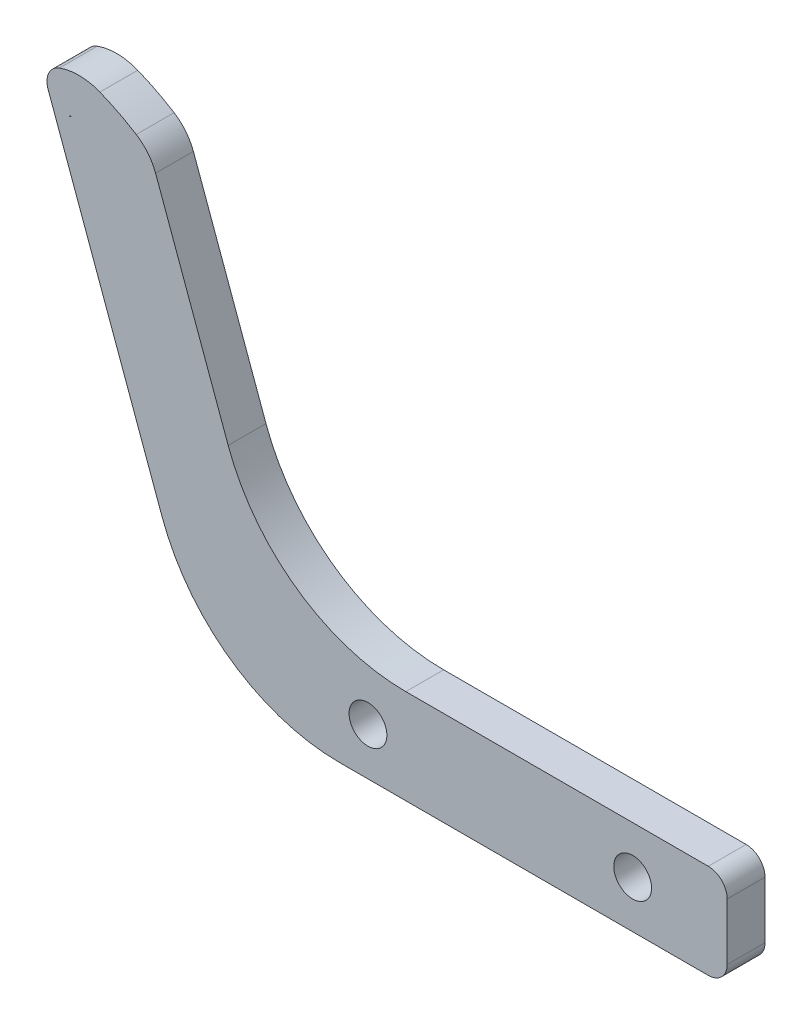
ISO-10303-21;
HEADER;
FILE_DESCRIPTION(('STEP AP214'),'2;1');
FILE_NAME('part.step','',(''),(''),'','','');
FILE_SCHEMA(('AUTOMOTIVE_DESIGN { 1 0 10303 214 1 1 1 1 }'));
ENDSEC;
DATA;
#1=APPLICATION_CONTEXT('core data for automotive mechanical design processes');
#2=APPLICATION_PROTOCOL_DEFINITION('international standard','automotive_design',2000,#1);
#3=PRODUCT_CONTEXT('',#1,'mechanical');
#4=PRODUCT('Part','Part','',(#3));
#5=PRODUCT_RELATED_PRODUCT_CATEGORY('part','',(#4));
#6=PRODUCT_DEFINITION_FORMATION('','',#4);
#7=PRODUCT_DEFINITION_CONTEXT('part definition',#1,'design');
#8=PRODUCT_DEFINITION('design','',#6,#7);
#9=PRODUCT_DEFINITION_SHAPE('','',#8);
#10=(LENGTH_UNIT() NAMED_UNIT(*) SI_UNIT(.MILLI.,.METRE.));
#11=(NAMED_UNIT(*) PLANE_ANGLE_UNIT() SI_UNIT($,.RADIAN.));
#12=(NAMED_UNIT(*) SI_UNIT($,.STERADIAN.) SOLID_ANGLE_UNIT());
#13=UNCERTAINTY_MEASURE_WITH_UNIT(LENGTH_MEASURE(1.E-05),#10,'distance_accuracy_value','');
#14=(GEOMETRIC_REPRESENTATION_CONTEXT(3) GLOBAL_UNCERTAINTY_ASSIGNED_CONTEXT((#13)) GLOBAL_UNIT_ASSIGNED_CONTEXT((#10,
#11,#12)) REPRESENTATION_CONTEXT('',''));
#15=CARTESIAN_POINT('',(0.,0.,0.));
#16=DIRECTION('',(0.,0.,1.));
#17=DIRECTION('',(1.,0.,0.));
#18=AXIS2_PLACEMENT_3D('',#15,#16,#17);
#19=CARTESIAN_POINT('',(-58.5846758968649,38.1711990775723,4.));
#20=DIRECTION('',(0.,0.,-1.));
#21=DIRECTION('',(-1.,0.,0.));
#22=AXIS2_PLACEMENT_3D('',#19,#20,#21);
#23=CYLINDRICAL_SURFACE('',#22,2.);
#24=CARTESIAN_POINT('',(-58.5846758968649,38.1711990775723,0.));
#25=DIRECTION('',(0.,0.,1.));
#26=DIRECTION('',(1.,0.,0.));
#27=AXIS2_PLACEMENT_3D('',#24,#25,#26);
#28=CIRCLE('',#27,2.);
#29=CARTESIAN_POINT('',(-59.572682652042,39.9101190445991,0.));
#30=VERTEX_POINT('',#29);
#31=CARTESIAN_POINT('',(-59.2687161835162,40.0505843191441,0.));
#32=VERTEX_POINT('',#31);
#33=EDGE_CURVE('E173',#30,#32,#28,.F.);
#34=ORIENTED_EDGE('',*,*,#33,.F.);
#35=DIRECTION('',(0.,0.,1.));
#36=VECTOR('',#35,1.);
#37=CARTESIAN_POINT('',(-59.572682652042,39.9101190445991,0.));
#38=LINE('',#37,#36);
#39=CARTESIAN_POINT('',(-59.572682652042,39.9101190445991,4.));
#40=VERTEX_POINT('',#39);
#41=EDGE_CURVE('E165',#30,#40,#38,.T.);
#42=ORIENTED_EDGE('',*,*,#41,.T.);
#43=CARTESIAN_POINT('',(-58.5846758968649,38.1711990775723,4.));
#44=DIRECTION('',(0.,0.,1.));
#45=DIRECTION('',(1.,0.,0.));
#46=AXIS2_PLACEMENT_3D('',#43,#44,#45);
#47=CIRCLE('',#46,2.);
#48=CARTESIAN_POINT('',(-59.2687161835162,40.0505843191441,4.));
#49=VERTEX_POINT('',#48);
#50=EDGE_CURVE('E285',#49,#40,#47,.T.);
#51=ORIENTED_EDGE('',*,*,#50,.F.);
#52=DIRECTION('',(0.,0.,1.));
#53=VECTOR('',#52,1.);
#54=CARTESIAN_POINT('',(-59.2687161835162,40.0505843191441,0.));
#55=LINE('',#54,#53);
#56=EDGE_CURVE('E158',#32,#49,#55,.T.);
#57=ORIENTED_EDGE('',*,*,#56,.F.);
#58=EDGE_LOOP('',(#34,#42,#51,#57));
#59=FACE_BOUND('',#58,.T.);
#60=ADVANCED_FACE('F37',(#59),#23,.T.);
#61=CARTESIAN_POINT('',(-31.9460427865344,-11.6274086768929,4.));
#62=DIRECTION('',(0.93969262078591,0.342020143325665,0.));
#63=DIRECTION('',(-0.342020143325665,0.93969262078591,0.));
#64=AXIS2_PLACEMENT_3D('',#61,#62,#63);
#65=PLANE('',#64);
#66=DIRECTION('',(0.342020143325665,-0.93969262078591,0.));
#67=VECTOR('',#66,1.);
#68=CARTESIAN_POINT('',(-31.9460427865344,-11.6274086768929,0.));
#69=LINE('',#68,#67);
#70=CARTESIAN_POINT('',(-50.4670591952752,39.2586656914718,0.));
#71=VERTEX_POINT('',#70);
#72=CARTESIAN_POINT('',(-42.7876262694269,18.1595971334867,0.));
#73=VERTEX_POINT('',#72);
#74=EDGE_CURVE('E233',#71,#73,#69,.T.);
#75=ORIENTED_EDGE('',*,*,#74,.F.);
#76=DIRECTION('',(0.,0.,1.));
#77=VECTOR('',#76,1.);
#78=CARTESIAN_POINT('',(-50.4670591952752,39.2586656914718,0.));
#79=LINE('',#78,#77);
#80=CARTESIAN_POINT('',(-50.4670591952752,39.2586656914718,4.));
#81=VERTEX_POINT('',#80);
#82=EDGE_CURVE('E212',#71,#81,#79,.T.);
#83=ORIENTED_EDGE('',*,*,#82,.T.);
#84=DIRECTION('',(0.342020143325665,-0.93969262078591,0.));
#85=VECTOR('',#84,1.);
#86=CARTESIAN_POINT('',(-31.9460427865344,-11.6274086768929,4.));
#87=LINE('',#86,#85);
#88=CARTESIAN_POINT('',(-42.7876262694269,18.1595971334867,4.));
#89=VERTEX_POINT('',#88);
#90=EDGE_CURVE('E216',#81,#89,#87,.T.);
#91=ORIENTED_EDGE('',*,*,#90,.T.);
#92=DIRECTION('',(0.,0.,-1.));
#93=VECTOR('',#92,1.);
#94=CARTESIAN_POINT('',(-42.7876262694268,18.1595971334867,0.));
#95=LINE('',#94,#93);
#96=EDGE_CURVE('E263',#89,#73,#95,.T.);
#97=ORIENTED_EDGE('',*,*,#96,.T.);
#98=EDGE_LOOP('',(#75,#83,#91,#97));
#99=FACE_BOUND('',#98,.T.);
#100=ADVANCED_FACE('F335',(#99),#65,.T.);
#101=CARTESIAN_POINT('',(-41.3429689943934,-15.0476101101496,4.));
#102=DIRECTION('',(0.939692620785909,0.342020143325666,0.));
#103=DIRECTION('',(-0.342020143325666,0.939692620785909,0.));
#104=AXIS2_PLACEMENT_3D('',#101,#102,#103);
#105=PLANE('',#104);
#106=DIRECTION('',(0.342020143325666,-0.939692620785909,0.));
#107=VECTOR('',#106,1.);
#108=CARTESIAN_POINT('',(-41.3429689943934,-15.0476101101496,4.));
#109=LINE('',#108,#107);
#110=CARTESIAN_POINT('',(-61.8321417117394,41.2459292740646,4.));
#111=VERTEX_POINT('',#110);
#112=CARTESIAN_POINT('',(-49.789701651524,8.15959713348668,4.));
#113=VERTEX_POINT('',#112);
#114=EDGE_CURVE('E218',#111,#113,#109,.T.);
#115=ORIENTED_EDGE('',*,*,#114,.F.);
#116=DIRECTION('',(0.,0.,1.));
#117=VECTOR('',#116,1.);
#118=CARTESIAN_POINT('',(-61.8321417117394,41.2459292740646,0.));
#119=LINE('',#118,#117);
#120=CARTESIAN_POINT('',(-61.8321417117394,41.2459292740646,0.));
#121=VERTEX_POINT('',#120);
#122=EDGE_CURVE('E203',#121,#111,#119,.T.);
#123=ORIENTED_EDGE('',*,*,#122,.F.);
#124=DIRECTION('',(0.342020143325666,-0.939692620785909,0.));
#125=VECTOR('',#124,1.);
#126=CARTESIAN_POINT('',(-41.3429689943934,-15.0476101101496,0.));
#127=LINE('',#126,#125);
#128=CARTESIAN_POINT('',(-49.789701651524,8.15959713348668,0.));
#129=VERTEX_POINT('',#128);
#130=EDGE_CURVE('E235',#121,#129,#127,.T.);
#131=ORIENTED_EDGE('',*,*,#130,.T.);
#132=DIRECTION('',(0.,0.,-1.));
#133=VECTOR('',#132,1.);
#134=CARTESIAN_POINT('',(-49.789701651524,8.15959713348668,4.));
#135=LINE('',#134,#133);
#136=EDGE_CURVE('E258',#129,#113,#135,.F.);
#137=ORIENTED_EDGE('',*,*,#136,.T.);
#138=EDGE_LOOP('',(#115,#123,#131,#137));
#139=FACE_BOUND('',#138,.T.);
#140=ADVANCED_FACE('F312',(#139),#105,.F.);
#141=CARTESIAN_POINT('',(0.,-5.,4.));
#142=DIRECTION('',(0.,1.,0.));
#143=DIRECTION('',(0.,0.,1.));
#144=AXIS2_PLACEMENT_3D('',#141,#142,#143);
#145=PLANE('',#144);
#146=DIRECTION('',(1.,0.,0.));
#147=VECTOR('',#146,1.);
#148=CARTESIAN_POINT('',(0.,-5.,0.));
#149=LINE('',#148,#147);
#150=CARTESIAN_POINT('',(-30.9958492358058,-5.,0.));
#151=VERTEX_POINT('',#150);
#152=CARTESIAN_POINT('',(8.,-5.,0.));
#153=VERTEX_POINT('',#152);
#154=EDGE_CURVE('E238',#151,#153,#149,.T.);
#155=ORIENTED_EDGE('',*,*,#154,.T.);
#156=DIRECTION('',(0.,0.,-1.));
#157=VECTOR('',#156,1.);
#158=CARTESIAN_POINT('',(8.,-5.,4.));
#159=LINE('',#158,#157);
#160=CARTESIAN_POINT('',(8.,-5.,4.));
#161=VERTEX_POINT('',#160);
#162=EDGE_CURVE('E283',#153,#161,#159,.F.);
#163=ORIENTED_EDGE('',*,*,#162,.T.);
#164=DIRECTION('',(1.,0.,0.));
#165=VECTOR('',#164,1.);
#166=CARTESIAN_POINT('',(0.,-5.,4.));
#167=LINE('',#166,#165);
#168=CARTESIAN_POINT('',(-30.9958492358058,-5.,4.));
#169=VERTEX_POINT('',#168);
#170=EDGE_CURVE('E221',#169,#161,#167,.T.);
#171=ORIENTED_EDGE('',*,*,#170,.F.);
#172=DIRECTION('',(0.,0.,-1.));
#173=VECTOR('',#172,1.);
#174=CARTESIAN_POINT('',(-30.9958492358058,-5.,4.));
#175=LINE('',#174,#173);
#176=EDGE_CURVE('E232',#169,#151,#175,.T.);
#177=ORIENTED_EDGE('',*,*,#176,.T.);
#178=EDGE_LOOP('',(#155,#163,#171,#177));
#179=FACE_BOUND('',#178,.T.);
#180=ADVANCED_FACE('F302',(#179),#145,.F.);
#181=CARTESIAN_POINT('',(-28.,0.,4.));
#182=DIRECTION('',(0.,0.,-1.));
#183=DIRECTION('',(-1.,0.,0.));
#184=AXIS2_PLACEMENT_3D('',#181,#182,#183);
#185=CYLINDRICAL_SURFACE('',#184,2.);
#186=CARTESIAN_POINT('',(-28.,0.,4.));
#187=DIRECTION('',(0.,0.,1.));
#188=DIRECTION('',(1.,0.,0.));
#189=AXIS2_PLACEMENT_3D('',#186,#187,#188);
#190=CIRCLE('',#189,2.);
#191=CARTESIAN_POINT('',(-26.,0.,4.));
#192=VERTEX_POINT('',#191);
#193=EDGE_CURVE('E226',#192,#192,#190,.T.);
#194=ORIENTED_EDGE('',*,*,#193,.T.);
#195=EDGE_LOOP('',(#194));
#196=FACE_BOUND('',#195,.T.);
#197=CARTESIAN_POINT('',(-28.,0.,0.));
#198=DIRECTION('',(0.,0.,1.));
#199=DIRECTION('',(1.,0.,0.));
#200=AXIS2_PLACEMENT_3D('',#197,#198,#199);
#201=CIRCLE('',#200,2.);
#202=CARTESIAN_POINT('',(-26.,0.,0.));
#203=VERTEX_POINT('',#202);
#204=EDGE_CURVE('E244',#203,#203,#201,.T.);
#205=ORIENTED_EDGE('',*,*,#204,.F.);
#206=EDGE_LOOP('',(#205));
#207=FACE_BOUND('',#206,.T.);
#208=ADVANCED_FACE('F512',(#196,#207),#185,.F.);
#209=CARTESIAN_POINT('',(0.,5.,4.));
#210=DIRECTION('',(0.,1.,0.));
#211=DIRECTION('',(0.,0.,1.));
#212=AXIS2_PLACEMENT_3D('',#209,#210,#211);
#213=PLANE('',#212);
#214=DIRECTION('',(1.,0.,0.));
#215=VECTOR('',#214,1.);
#216=CARTESIAN_POINT('',(0.,5.,4.));
#217=LINE('',#216,#215);
#218=CARTESIAN_POINT('',(-23.9937738537087,5.,4.));
#219=VERTEX_POINT('',#218);
#220=CARTESIAN_POINT('',(8.,5.,4.));
#221=VERTEX_POINT('',#220);
#222=EDGE_CURVE('E224',#219,#221,#217,.T.);
#223=ORIENTED_EDGE('',*,*,#222,.T.);
#224=DIRECTION('',(0.,0.,-1.));
#225=VECTOR('',#224,1.);
#226=CARTESIAN_POINT('',(8.,5.,4.));
#227=LINE('',#226,#225);
#228=CARTESIAN_POINT('',(8.,5.,0.));
#229=VERTEX_POINT('',#228);
#230=EDGE_CURVE('E11',#221,#229,#227,.T.);
#231=ORIENTED_EDGE('',*,*,#230,.T.);
#232=DIRECTION('',(1.,0.,0.));
#233=VECTOR('',#232,1.);
#234=CARTESIAN_POINT('',(0.,5.,0.));
#235=LINE('',#234,#233);
#236=CARTESIAN_POINT('',(-23.9937738537087,5.,0.));
#237=VERTEX_POINT('',#236);
#238=EDGE_CURVE('E241',#237,#229,#235,.T.);
#239=ORIENTED_EDGE('',*,*,#238,.F.);
#240=DIRECTION('',(0.,0.,-1.));
#241=VECTOR('',#240,1.);
#242=CARTESIAN_POINT('',(-23.9937738537087,5.,4.));
#243=LINE('',#242,#241);
#244=EDGE_CURVE('E266',#237,#219,#243,.F.);
#245=ORIENTED_EDGE('',*,*,#244,.T.);
#246=EDGE_LOOP('',(#223,#231,#239,#245));
#247=FACE_BOUND('',#246,.T.);
#248=ADVANCED_FACE('F338',(#247),#213,.T.);
#249=CARTESIAN_POINT('',(0.,0.,4.));
#250=DIRECTION('',(0.,0.,-1.));
#251=DIRECTION('',(-1.,0.,0.));
#252=AXIS2_PLACEMENT_3D('',#249,#250,#251);
#253=CYLINDRICAL_SURFACE('',#252,2.);
#254=CARTESIAN_POINT('',(0.,0.,4.));
#255=DIRECTION('',(0.,0.,1.));
#256=DIRECTION('',(1.,0.,0.));
#257=AXIS2_PLACEMENT_3D('',#254,#255,#256);
#258=CIRCLE('',#257,2.);
#259=CARTESIAN_POINT('',(2.,0.,4.));
#260=VERTEX_POINT('',#259);
#261=EDGE_CURVE('E229',#260,#260,#258,.T.);
#262=ORIENTED_EDGE('',*,*,#261,.T.);
#263=EDGE_LOOP('',(#262));
#264=FACE_BOUND('',#263,.T.);
#265=CARTESIAN_POINT('',(0.,0.,0.));
#266=DIRECTION('',(0.,0.,1.));
#267=DIRECTION('',(1.,0.,0.));
#268=AXIS2_PLACEMENT_3D('',#265,#266,#267);
#269=CIRCLE('',#268,2.);
#270=CARTESIAN_POINT('',(2.,0.,0.));
#271=VERTEX_POINT('',#270);
#272=EDGE_CURVE('E219',#271,#271,#269,.T.);
#273=ORIENTED_EDGE('',*,*,#272,.F.);
#274=EDGE_LOOP('',(#273));
#275=FACE_BOUND('',#274,.T.);
#276=ADVANCED_FACE('F415',(#264,#275),#253,.F.);
#277=CARTESIAN_POINT('',(0.,0.,4.));
#278=DIRECTION('',(0.,0.,1.));
#279=DIRECTION('',(1.,0.,0.));
#280=AXIS2_PLACEMENT_3D('',#277,#278,#279);
#281=PLANE('',#280);
#282=CARTESIAN_POINT('',(-59.9527564701676,41.929969560716,4.));
#283=DIRECTION('',(0.,0.,1.));
#284=DIRECTION('',(1.,0.,0.));
#285=AXIS2_PLACEMENT_3D('',#282,#283,#284);
#286=CIRCLE('',#285,2.);
#287=CARTESIAN_POINT('',(-60.6367967568189,43.8093548022878,4.));
#288=VERTEX_POINT('',#287);
#289=EDGE_CURVE('E169',#288,#111,#286,.T.);
#290=ORIENTED_EDGE('',*,*,#289,.T.);
#291=ORIENTED_EDGE('',*,*,#114,.T.);
#292=CARTESIAN_POINT('',(-30.9958492358058,15.,4.));
#293=DIRECTION('',(0.,0.,1.));
#294=DIRECTION('',(1.,0.,0.));
#295=AXIS2_PLACEMENT_3D('',#292,#293,#294);
#296=CIRCLE('',#295,20.);
#297=EDGE_CURVE('E261',#113,#169,#296,.T.);
#298=ORIENTED_EDGE('',*,*,#297,.T.);
#299=ORIENTED_EDGE('',*,*,#170,.T.);
#300=CARTESIAN_POINT('',(8.,-3.,4.));
#301=DIRECTION('',(0.,0.,1.));
#302=DIRECTION('',(1.,0.,0.));
#303=AXIS2_PLACEMENT_3D('',#300,#301,#302);
#304=CIRCLE('',#303,2.);
#305=CARTESIAN_POINT('',(10.,-3.,4.));
#306=VERTEX_POINT('',#305);
#307=EDGE_CURVE('E44',#161,#306,#304,.T.);
#308=ORIENTED_EDGE('',*,*,#307,.T.);
#309=DIRECTION('',(0.,-1.,0.));
#310=VECTOR('',#309,1.);
#311=CARTESIAN_POINT('',(10.,5.,4.));
#312=LINE('',#311,#310);
#313=CARTESIAN_POINT('',(10.,3.,4.));
#314=VERTEX_POINT('',#313);
#315=EDGE_CURVE('E236',#314,#306,#312,.T.);
#316=ORIENTED_EDGE('',*,*,#315,.F.);
#317=CARTESIAN_POINT('',(8.,3.,4.));
#318=DIRECTION('',(0.,0.,1.));
#319=DIRECTION('',(1.,0.,0.));
#320=AXIS2_PLACEMENT_3D('',#317,#318,#319);
#321=CIRCLE('',#320,2.);
#322=EDGE_CURVE('E59',#314,#221,#321,.T.);
#323=ORIENTED_EDGE('',*,*,#322,.T.);
#324=ORIENTED_EDGE('',*,*,#222,.F.);
#325=CARTESIAN_POINT('',(-23.9937738537087,25.,4.));
#326=DIRECTION('',(0.,0.,1.));
#327=DIRECTION('',(1.,0.,0.));
#328=AXIS2_PLACEMENT_3D('',#325,#326,#327);
#329=CIRCLE('',#328,20.);
#330=EDGE_CURVE('E270',#219,#89,#329,.F.);
#331=ORIENTED_EDGE('',*,*,#330,.T.);
#332=ORIENTED_EDGE('',*,*,#90,.F.);
#333=CARTESIAN_POINT('',(-55.1655222992048,37.5485649748434,4.));
#334=DIRECTION('',(0.,0.,1.));
#335=DIRECTION('',(1.,0.,0.));
#336=AXIS2_PLACEMENT_3D('',#333,#334,#335);
#337=CIRCLE('',#336,5.);
#338=CARTESIAN_POINT('',(-52.5058424817868,41.7824878920467,4.));
#339=VERTEX_POINT('',#338);
#340=EDGE_CURVE('E190',#81,#339,#337,.T.);
#341=ORIENTED_EDGE('',*,*,#340,.T.);
#342=CARTESIAN_POINT('',(-65.2723056053933,21.459657889471,4.));
#343=DIRECTION('',(0.,0.,1.));
#344=DIRECTION('',(1.,0.,0.));
#345=AXIS2_PLACEMENT_3D('',#342,#343,#344);
#346=CIRCLE('',#345,24.);
#347=CARTESIAN_POINT('',(-56.3554659940221,43.7417128069394,4.));
#348=VERTEX_POINT('',#347);
#349=EDGE_CURVE('E193',#339,#348,#346,.T.);
#350=ORIENTED_EDGE('',*,*,#349,.T.);
#351=CARTESIAN_POINT('',(-58.5846758968649,38.1711990775723,4.));
#352=DIRECTION('',(0.,0.,1.));
#353=DIRECTION('',(1.,0.,0.));
#354=AXIS2_PLACEMENT_3D('',#351,#352,#353);
#355=CIRCLE('',#354,6.);
#356=EDGE_CURVE('E196',#348,#288,#355,.T.);
#357=ORIENTED_EDGE('',*,*,#356,.T.);
#358=EDGE_LOOP('',(#290,#291,#298,#299,#308,#316,#323,#324,#331,#332,#341,#350,#357));
#359=FACE_BOUND('',#358,.T.);
#360=ORIENTED_EDGE('',*,*,#50,.T.);
#361=CARTESIAN_POINT('',(-55.1655222992048,37.5485649748434,4.));
#362=DIRECTION('',(0.,0.,1.));
#363=DIRECTION('',(1.,0.,0.));
#364=AXIS2_PLACEMENT_3D('',#361,#362,#363);
#365=CIRCLE('',#364,5.);
#366=CARTESIAN_POINT('',(-59.5381790307102,39.9734099406959,4.));
#367=VERTEX_POINT('',#366);
#368=EDGE_CURVE('E187',#367,#40,#365,.T.);
#369=ORIENTED_EDGE('',*,*,#368,.F.);
#370=CARTESIAN_POINT('',(-59.9527564701676,41.929969560716,4.));
#371=DIRECTION('',(0.,0.,1.));
#372=DIRECTION('',(1.,0.,0.));
#373=AXIS2_PLACEMENT_3D('',#370,#371,#372);
#374=CIRCLE('',#373,2.);
#375=EDGE_CURVE('E51',#367,#49,#374,.T.);
#376=ORIENTED_EDGE('',*,*,#375,.T.);
#377=EDGE_LOOP('',(#360,#369,#376));
#378=FACE_BOUND('',#377,.T.);
#379=ORIENTED_EDGE('',*,*,#193,.F.);
#380=EDGE_LOOP('',(#379));
#381=FACE_BOUND('',#380,.T.);
#382=ORIENTED_EDGE('',*,*,#261,.F.);
#383=EDGE_LOOP('',(#382));
#384=FACE_BOUND('',#383,.T.);
#385=ADVANCED_FACE('F288',(#359,#378,#381,#384),#281,.T.);
#386=CARTESIAN_POINT('',(0.,0.,0.));
#387=DIRECTION('',(0.,0.,1.));
#388=DIRECTION('',(1.,0.,0.));
#389=AXIS2_PLACEMENT_3D('',#386,#387,#388);
#390=PLANE('',#389);
#391=CARTESIAN_POINT('',(-55.1655222992048,37.5485649748434,0.));
#392=DIRECTION('',(0.,0.,1.));
#393=DIRECTION('',(1.,0.,0.));
#394=AXIS2_PLACEMENT_3D('',#391,#392,#393);
#395=CIRCLE('',#394,5.);
#396=CARTESIAN_POINT('',(-52.5058424817868,41.7824878920467,0.));
#397=VERTEX_POINT('',#396);
#398=EDGE_CURVE('E174',#71,#397,#395,.T.);
#399=ORIENTED_EDGE('',*,*,#398,.F.);
#400=ORIENTED_EDGE('',*,*,#74,.T.);
#401=CARTESIAN_POINT('',(-23.9937738537087,25.,0.));
#402=DIRECTION('',(0.,0.,1.));
#403=DIRECTION('',(1.,0.,0.));
#404=AXIS2_PLACEMENT_3D('',#401,#402,#403);
#405=CIRCLE('',#404,20.);
#406=EDGE_CURVE('E268',#73,#237,#405,.T.);
#407=ORIENTED_EDGE('',*,*,#406,.T.);
#408=ORIENTED_EDGE('',*,*,#238,.T.);
#409=CARTESIAN_POINT('',(8.,3.,0.));
#410=DIRECTION('',(0.,0.,1.));
#411=DIRECTION('',(1.,0.,0.));
#412=AXIS2_PLACEMENT_3D('',#409,#410,#411);
#413=CIRCLE('',#412,2.);
#414=CARTESIAN_POINT('',(10.,3.,0.));
#415=VERTEX_POINT('',#414);
#416=EDGE_CURVE('E279',#229,#415,#413,.F.);
#417=ORIENTED_EDGE('',*,*,#416,.T.);
#418=DIRECTION('',(0.,-1.,0.));
#419=VECTOR('',#418,1.);
#420=CARTESIAN_POINT('',(10.,5.,0.));
#421=LINE('',#420,#419);
#422=CARTESIAN_POINT('',(10.,-3.,0.));
#423=VERTEX_POINT('',#422);
#424=EDGE_CURVE('E202',#415,#423,#421,.T.);
#425=ORIENTED_EDGE('',*,*,#424,.T.);
#426=CARTESIAN_POINT('',(8.,-3.,0.));
#427=DIRECTION('',(0.,0.,1.));
#428=DIRECTION('',(1.,0.,0.));
#429=AXIS2_PLACEMENT_3D('',#426,#427,#428);
#430=CIRCLE('',#429,2.);
#431=EDGE_CURVE('E281',#423,#153,#430,.F.);
#432=ORIENTED_EDGE('',*,*,#431,.T.);
#433=ORIENTED_EDGE('',*,*,#154,.F.);
#434=CARTESIAN_POINT('',(-30.9958492358058,15.,0.));
#435=DIRECTION('',(0.,0.,1.));
#436=DIRECTION('',(1.,0.,0.));
#437=AXIS2_PLACEMENT_3D('',#434,#435,#436);
#438=CIRCLE('',#437,20.);
#439=EDGE_CURVE('E255',#151,#129,#438,.F.);
#440=ORIENTED_EDGE('',*,*,#439,.T.);
#441=ORIENTED_EDGE('',*,*,#130,.F.);
#442=CARTESIAN_POINT('',(-59.9527564701676,41.929969560716,0.));
#443=DIRECTION('',(0.,0.,1.));
#444=DIRECTION('',(1.,0.,0.));
#445=AXIS2_PLACEMENT_3D('',#442,#443,#444);
#446=CIRCLE('',#445,2.);
#447=CARTESIAN_POINT('',(-60.6367967568189,43.8093548022878,0.));
#448=VERTEX_POINT('',#447);
#449=EDGE_CURVE('E159',#448,#121,#446,.T.);
#450=ORIENTED_EDGE('',*,*,#449,.F.);
#451=CARTESIAN_POINT('',(-58.5846758968649,38.1711990775723,0.));
#452=DIRECTION('',(0.,0.,1.));
#453=DIRECTION('',(1.,0.,0.));
#454=AXIS2_PLACEMENT_3D('',#451,#452,#453);
#455=CIRCLE('',#454,6.);
#456=CARTESIAN_POINT('',(-56.3554659940221,43.7417128069394,0.));
#457=VERTEX_POINT('',#456);
#458=EDGE_CURVE('E182',#457,#448,#455,.T.);
#459=ORIENTED_EDGE('',*,*,#458,.F.);
#460=CARTESIAN_POINT('',(-65.2723056053933,21.459657889471,0.));
#461=DIRECTION('',(0.,0.,1.));
#462=DIRECTION('',(1.,0.,0.));
#463=AXIS2_PLACEMENT_3D('',#460,#461,#462);
#464=CIRCLE('',#463,24.);
#465=EDGE_CURVE('E177',#397,#457,#464,.T.);
#466=ORIENTED_EDGE('',*,*,#465,.F.);
#467=EDGE_LOOP('',(#399,#400,#407,#408,#417,#425,#432,#433,#440,#441,#450,#459,#466));
#468=FACE_BOUND('',#467,.T.);
#469=CARTESIAN_POINT('',(-55.1655222992048,37.5485649748434,0.));
#470=DIRECTION('',(0.,0.,1.));
#471=DIRECTION('',(1.,0.,0.));
#472=AXIS2_PLACEMENT_3D('',#469,#470,#471);
#473=CIRCLE('',#472,5.);
#474=CARTESIAN_POINT('',(-59.5381790307102,39.9734099406959,0.));
#475=VERTEX_POINT('',#474);
#476=EDGE_CURVE('E162',#475,#30,#473,.T.);
#477=ORIENTED_EDGE('',*,*,#476,.T.);
#478=ORIENTED_EDGE('',*,*,#33,.T.);
#479=CARTESIAN_POINT('',(-59.9527564701676,41.929969560716,0.));
#480=DIRECTION('',(0.,0.,1.));
#481=DIRECTION('',(1.,0.,0.));
#482=AXIS2_PLACEMENT_3D('',#479,#480,#481);
#483=CIRCLE('',#482,2.);
#484=EDGE_CURVE('E155',#475,#32,#483,.T.);
#485=ORIENTED_EDGE('',*,*,#484,.F.);
#486=EDGE_LOOP('',(#477,#478,#485));
#487=FACE_BOUND('',#486,.T.);
#488=ORIENTED_EDGE('',*,*,#204,.T.);
#489=EDGE_LOOP('',(#488));
#490=FACE_BOUND('',#489,.T.);
#491=ORIENTED_EDGE('',*,*,#272,.T.);
#492=EDGE_LOOP('',(#491));
#493=FACE_BOUND('',#492,.T.);
#494=ADVANCED_FACE('F171',(#468,#487,#490,#493),#390,.F.);
#495=CARTESIAN_POINT('',(10.,5.,4.));
#496=DIRECTION('',(1.,0.,0.));
#497=DIRECTION('',(0.,0.,-1.));
#498=AXIS2_PLACEMENT_3D('',#495,#496,#497);
#499=PLANE('',#498);
#500=ORIENTED_EDGE('',*,*,#315,.T.);
#501=DIRECTION('',(0.,0.,-1.));
#502=VECTOR('',#501,1.);
#503=CARTESIAN_POINT('',(10.,-3.,0.));
#504=LINE('',#503,#502);
#505=EDGE_CURVE('E275',#306,#423,#504,.T.);
#506=ORIENTED_EDGE('',*,*,#505,.T.);
#507=ORIENTED_EDGE('',*,*,#424,.F.);
#508=DIRECTION('',(0.,0.,-1.));
#509=VECTOR('',#508,1.);
#510=CARTESIAN_POINT('',(10.,3.,4.));
#511=LINE('',#510,#509);
#512=EDGE_CURVE('E273',#415,#314,#511,.F.);
#513=ORIENTED_EDGE('',*,*,#512,.T.);
#514=EDGE_LOOP('',(#500,#506,#507,#513));
#515=FACE_BOUND('',#514,.T.);
#516=ADVANCED_FACE('F294',(#515),#499,.T.);
#517=CARTESIAN_POINT('',(-30.9958492358058,15.,4.));
#518=DIRECTION('',(0.,0.,-1.));
#519=DIRECTION('',(-1.,0.,0.));
#520=AXIS2_PLACEMENT_3D('',#517,#518,#519);
#521=CYLINDRICAL_SURFACE('',#520,20.);
#522=ORIENTED_EDGE('',*,*,#297,.F.);
#523=ORIENTED_EDGE('',*,*,#136,.F.);
#524=ORIENTED_EDGE('',*,*,#439,.F.);
#525=ORIENTED_EDGE('',*,*,#176,.F.);
#526=EDGE_LOOP('',(#522,#523,#524,#525));
#527=FACE_BOUND('',#526,.T.);
#528=ADVANCED_FACE('F306',(#527),#521,.T.);
#529=CARTESIAN_POINT('',(-23.9937738537087,25.,4.));
#530=DIRECTION('',(0.,0.,1.));
#531=DIRECTION('',(1.,0.,0.));
#532=AXIS2_PLACEMENT_3D('',#529,#530,#531);
#533=CYLINDRICAL_SURFACE('',#532,20.);
#534=ORIENTED_EDGE('',*,*,#330,.F.);
#535=ORIENTED_EDGE('',*,*,#244,.F.);
#536=ORIENTED_EDGE('',*,*,#406,.F.);
#537=ORIENTED_EDGE('',*,*,#96,.F.);
#538=EDGE_LOOP('',(#534,#535,#536,#537));
#539=FACE_BOUND('',#538,.T.);
#540=ADVANCED_FACE('F334',(#539),#533,.F.);
#541=CARTESIAN_POINT('',(8.,-3.,4.));
#542=DIRECTION('',(0.,0.,1.));
#543=DIRECTION('',(1.,0.,0.));
#544=AXIS2_PLACEMENT_3D('',#541,#542,#543);
#545=CYLINDRICAL_SURFACE('',#544,2.);
#546=ORIENTED_EDGE('',*,*,#307,.F.);
#547=ORIENTED_EDGE('',*,*,#162,.F.);
#548=ORIENTED_EDGE('',*,*,#431,.F.);
#549=ORIENTED_EDGE('',*,*,#505,.F.);
#550=EDGE_LOOP('',(#546,#547,#548,#549));
#551=FACE_BOUND('',#550,.T.);
#552=ADVANCED_FACE('F297',(#551),#545,.T.);
#553=CARTESIAN_POINT('',(8.,3.,4.));
#554=DIRECTION('',(0.,0.,-1.));
#555=DIRECTION('',(-1.,0.,0.));
#556=AXIS2_PLACEMENT_3D('',#553,#554,#555);
#557=CYLINDRICAL_SURFACE('',#556,2.);
#558=ORIENTED_EDGE('',*,*,#322,.F.);
#559=ORIENTED_EDGE('',*,*,#512,.F.);
#560=ORIENTED_EDGE('',*,*,#416,.F.);
#561=ORIENTED_EDGE('',*,*,#230,.F.);
#562=EDGE_LOOP('',(#558,#559,#560,#561));
#563=FACE_BOUND('',#562,.T.);
#564=ADVANCED_FACE('F340',(#563),#557,.T.);
#565=CARTESIAN_POINT('',(-55.1655222992048,37.5485649748434,0.));
#566=DIRECTION('',(0.,0.,1.));
#567=DIRECTION('',(1.,0.,0.));
#568=AXIS2_PLACEMENT_3D('',#565,#566,#567);
#569=CYLINDRICAL_SURFACE('',#568,5.);
#570=ORIENTED_EDGE('',*,*,#368,.T.);
#571=ORIENTED_EDGE('',*,*,#41,.F.);
#572=ORIENTED_EDGE('',*,*,#476,.F.);
#573=DIRECTION('',(0.,0.,1.));
#574=VECTOR('',#573,1.);
#575=CARTESIAN_POINT('',(-59.5381790307102,39.9734099406959,0.));
#576=LINE('',#575,#574);
#577=EDGE_CURVE('E151',#475,#367,#576,.T.);
#578=ORIENTED_EDGE('',*,*,#577,.T.);
#579=EDGE_LOOP('',(#570,#571,#572,#578));
#580=FACE_BOUND('',#579,.T.);
#581=ADVANCED_FACE('F163',(#580),#569,.F.);
#582=CARTESIAN_POINT('',(-59.9527564701676,41.929969560716,0.));
#583=DIRECTION('',(0.,0.,1.));
#584=DIRECTION('',(1.,0.,0.));
#585=AXIS2_PLACEMENT_3D('',#582,#583,#584);
#586=CYLINDRICAL_SURFACE('',#585,2.);
#587=ORIENTED_EDGE('',*,*,#289,.F.);
#588=DIRECTION('',(0.,0.,1.));
#589=VECTOR('',#588,1.);
#590=CARTESIAN_POINT('',(-60.6367967568189,43.8093548022878,0.));
#591=LINE('',#590,#589);
#592=EDGE_CURVE('E206',#448,#288,#591,.T.);
#593=ORIENTED_EDGE('',*,*,#592,.F.);
#594=ORIENTED_EDGE('',*,*,#449,.T.);
#595=ORIENTED_EDGE('',*,*,#122,.T.);
#596=EDGE_LOOP('',(#587,#593,#594,#595));
#597=FACE_BOUND('',#596,.T.);
#598=ADVANCED_FACE('F315',(#597),#586,.T.);
#599=CARTESIAN_POINT('',(-58.5846758968649,38.1711990775723,0.));
#600=DIRECTION('',(0.,0.,1.));
#601=DIRECTION('',(1.,0.,0.));
#602=AXIS2_PLACEMENT_3D('',#599,#600,#601);
#603=CYLINDRICAL_SURFACE('',#602,6.);
#604=ORIENTED_EDGE('',*,*,#356,.F.);
#605=DIRECTION('',(0.,0.,1.));
#606=VECTOR('',#605,1.);
#607=CARTESIAN_POINT('',(-56.3554659940221,43.7417128069394,0.));
#608=LINE('',#607,#606);
#609=EDGE_CURVE('E208',#457,#348,#608,.T.);
#610=ORIENTED_EDGE('',*,*,#609,.F.);
#611=ORIENTED_EDGE('',*,*,#458,.T.);
#612=ORIENTED_EDGE('',*,*,#592,.T.);
#613=EDGE_LOOP('',(#604,#610,#611,#612));
#614=FACE_BOUND('',#613,.T.);
#615=ADVANCED_FACE('F318',(#614),#603,.T.);
#616=CARTESIAN_POINT('',(-65.2723056053933,21.459657889471,0.));
#617=DIRECTION('',(0.,0.,1.));
#618=DIRECTION('',(1.,0.,0.));
#619=AXIS2_PLACEMENT_3D('',#616,#617,#618);
#620=CYLINDRICAL_SURFACE('',#619,24.);
#621=ORIENTED_EDGE('',*,*,#349,.F.);
#622=DIRECTION('',(0.,0.,1.));
#623=VECTOR('',#622,1.);
#624=CARTESIAN_POINT('',(-52.5058424817868,41.7824878920467,0.));
#625=LINE('',#624,#623);
#626=EDGE_CURVE('E210',#397,#339,#625,.T.);
#627=ORIENTED_EDGE('',*,*,#626,.F.);
#628=ORIENTED_EDGE('',*,*,#465,.T.);
#629=ORIENTED_EDGE('',*,*,#609,.T.);
#630=EDGE_LOOP('',(#621,#627,#628,#629));
#631=FACE_BOUND('',#630,.T.);
#632=ADVANCED_FACE('F322',(#631),#620,.T.);
#633=CARTESIAN_POINT('',(-55.1655222992048,37.5485649748434,0.));
#634=DIRECTION('',(0.,0.,1.));
#635=DIRECTION('',(1.,0.,0.));
#636=AXIS2_PLACEMENT_3D('',#633,#634,#635);
#637=CYLINDRICAL_SURFACE('',#636,5.);
#638=ORIENTED_EDGE('',*,*,#340,.F.);
#639=ORIENTED_EDGE('',*,*,#82,.F.);
#640=ORIENTED_EDGE('',*,*,#398,.T.);
#641=ORIENTED_EDGE('',*,*,#626,.T.);
#642=EDGE_LOOP('',(#638,#639,#640,#641));
#643=FACE_BOUND('',#642,.T.);
#644=ADVANCED_FACE('F325',(#643),#637,.T.);
#645=CARTESIAN_POINT('',(-59.9527564701676,41.929969560716,0.));
#646=DIRECTION('',(0.,0.,1.));
#647=DIRECTION('',(1.,0.,0.));
#648=AXIS2_PLACEMENT_3D('',#645,#646,#647);
#649=CYLINDRICAL_SURFACE('',#648,2.);
#650=ORIENTED_EDGE('',*,*,#375,.F.);
#651=ORIENTED_EDGE('',*,*,#577,.F.);
#652=ORIENTED_EDGE('',*,*,#484,.T.);
#653=ORIENTED_EDGE('',*,*,#56,.T.);
#654=EDGE_LOOP('',(#650,#651,#652,#653));
#655=FACE_BOUND('',#654,.T.);
#656=ADVANCED_FACE('F153',(#655),#649,.T.);
#657=CLOSED_SHELL('',(#60,#100,#140,#180,#208,#248,#276,#385,#494,#516,#528,#540,#552,#564,#581,
#598,#615,#632,#644,#656));
#658=MANIFOLD_SOLID_BREP('B2',#657);
#659=ADVANCED_BREP_SHAPE_REPRESENTATION('',(#18,#658),#14);
#660=SHAPE_DEFINITION_REPRESENTATION(#9,#659);
ENDSEC;
END-ISO-10303-21;
